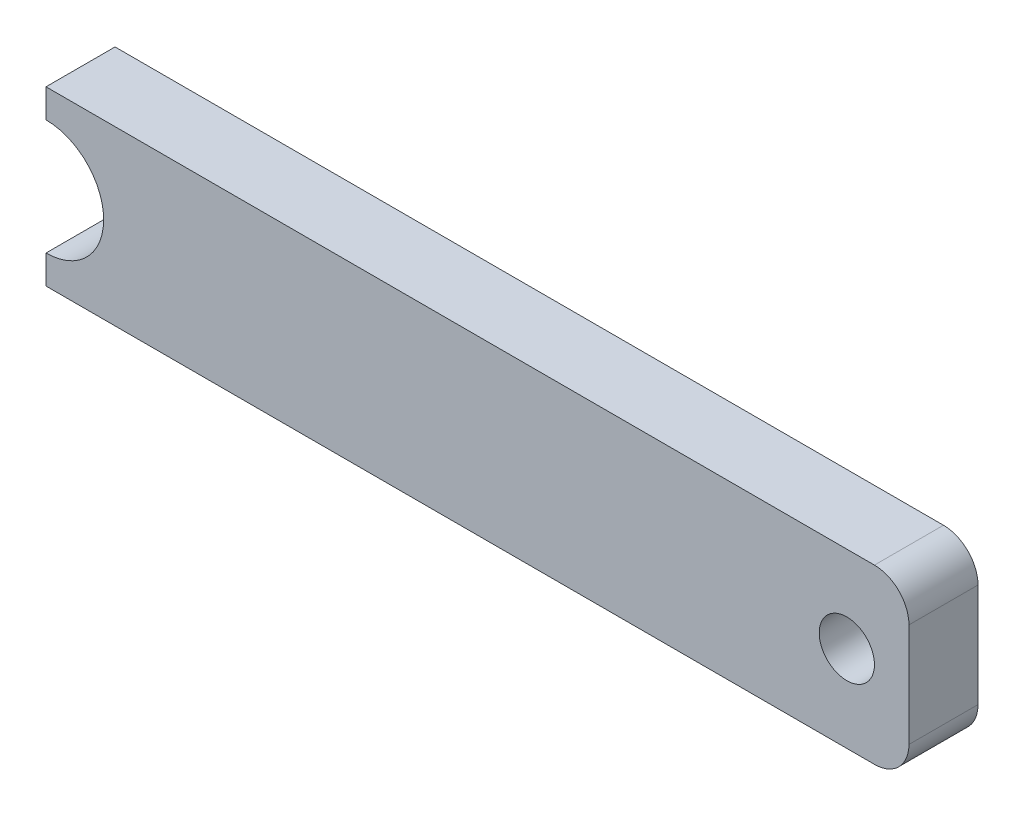
ISO-10303-21;
HEADER;
FILE_DESCRIPTION(('STEP AP214'),'2;1');
FILE_NAME('part.step','',(''),(''),'','','');
FILE_SCHEMA(('AUTOMOTIVE_DESIGN { 1 0 10303 214 1 1 1 1 }'));
ENDSEC;
DATA;
#1=APPLICATION_CONTEXT('core data for automotive mechanical design processes');
#2=APPLICATION_PROTOCOL_DEFINITION('international standard','automotive_design',2000,#1);
#3=PRODUCT_CONTEXT('',#1,'mechanical');
#4=PRODUCT('Part','Part','',(#3));
#5=PRODUCT_RELATED_PRODUCT_CATEGORY('part','',(#4));
#6=PRODUCT_DEFINITION_FORMATION('','',#4);
#7=PRODUCT_DEFINITION_CONTEXT('part definition',#1,'design');
#8=PRODUCT_DEFINITION('design','',#6,#7);
#9=PRODUCT_DEFINITION_SHAPE('','',#8);
#10=(LENGTH_UNIT() NAMED_UNIT(*) SI_UNIT(.MILLI.,.METRE.));
#11=(NAMED_UNIT(*) PLANE_ANGLE_UNIT() SI_UNIT($,.RADIAN.));
#12=(NAMED_UNIT(*) SI_UNIT($,.STERADIAN.) SOLID_ANGLE_UNIT());
#13=UNCERTAINTY_MEASURE_WITH_UNIT(LENGTH_MEASURE(1.E-05),#10,'distance_accuracy_value','');
#14=(GEOMETRIC_REPRESENTATION_CONTEXT(3) GLOBAL_UNCERTAINTY_ASSIGNED_CONTEXT((#13)) GLOBAL_UNIT_ASSIGNED_CONTEXT((#10,
#11,#12)) REPRESENTATION_CONTEXT('',''));
#15=CARTESIAN_POINT('',(0.,0.,0.));
#16=DIRECTION('',(0.,0.,1.));
#17=DIRECTION('',(1.,0.,0.));
#18=AXIS2_PLACEMENT_3D('',#15,#16,#17);
#19=CARTESIAN_POINT('',(-62.5,0.,10.));
#20=DIRECTION('',(0.,0.,1.));
#21=DIRECTION('',(1.,0.,0.));
#22=AXIS2_PLACEMENT_3D('',#19,#20,#21);
#23=PLANE('',#22);
#24=DIRECTION('',(0.,-1.,0.));
#25=VECTOR('',#24,1.);
#26=CARTESIAN_POINT('',(-62.5,12.5,10.));
#27=LINE('',#26,#25);
#28=CARTESIAN_POINT('',(-62.5,12.5,10.));
#29=VERTEX_POINT('',#28);
#30=CARTESIAN_POINT('',(-62.5,8.35,10.));
#31=VERTEX_POINT('',#30);
#32=EDGE_CURVE('E145',#29,#31,#27,.T.);
#33=ORIENTED_EDGE('',*,*,#32,.T.);
#34=CARTESIAN_POINT('',(-62.5,0.,10.));
#35=DIRECTION('',(0.,0.,-1.));
#36=DIRECTION('',(1.,0.,0.));
#37=AXIS2_PLACEMENT_3D('',#34,#35,#36);
#38=CIRCLE('',#37,8.35);
#39=CARTESIAN_POINT('',(-62.5,-8.35000000000001,10.));
#40=VERTEX_POINT('',#39);
#41=EDGE_CURVE('E93',#31,#40,#38,.T.);
#42=ORIENTED_EDGE('',*,*,#41,.T.);
#43=DIRECTION('',(0.,-1.,0.));
#44=VECTOR('',#43,1.);
#45=CARTESIAN_POINT('',(-62.5,-8.35000000000001,10.));
#46=LINE('',#45,#44);
#47=CARTESIAN_POINT('',(-62.5,-12.5,10.));
#48=VERTEX_POINT('',#47);
#49=EDGE_CURVE('E160',#40,#48,#46,.T.);
#50=ORIENTED_EDGE('',*,*,#49,.T.);
#51=DIRECTION('',(1.,0.,0.));
#52=VECTOR('',#51,1.);
#53=CARTESIAN_POINT('',(-62.5,-12.5,10.));
#54=LINE('',#53,#52);
#55=CARTESIAN_POINT('',(57.5,-12.5,10.));
#56=VERTEX_POINT('',#55);
#57=EDGE_CURVE('E173',#48,#56,#54,.T.);
#58=ORIENTED_EDGE('',*,*,#57,.T.);
#59=CARTESIAN_POINT('',(57.5,-7.50000000000001,10.));
#60=DIRECTION('',(0.,0.,1.));
#61=DIRECTION('',(-1.,0.,0.));
#62=AXIS2_PLACEMENT_3D('',#59,#60,#61);
#63=CIRCLE('',#62,5.);
#64=CARTESIAN_POINT('',(62.5,-7.49999999999997,10.));
#65=VERTEX_POINT('',#64);
#66=EDGE_CURVE('E112',#56,#65,#63,.T.);
#67=ORIENTED_EDGE('',*,*,#66,.T.);
#68=DIRECTION('',(0.,1.,0.));
#69=VECTOR('',#68,1.);
#70=CARTESIAN_POINT('',(62.5,7.49999999999996,10.));
#71=LINE('',#70,#69);
#72=CARTESIAN_POINT('',(62.5,7.49999999999996,10.));
#73=VERTEX_POINT('',#72);
#74=EDGE_CURVE('E106',#65,#73,#71,.T.);
#75=ORIENTED_EDGE('',*,*,#74,.T.);
#76=CARTESIAN_POINT('',(57.5,7.5,10.));
#77=DIRECTION('',(0.,0.,1.));
#78=DIRECTION('',(1.,0.,0.));
#79=AXIS2_PLACEMENT_3D('',#76,#77,#78);
#80=CIRCLE('',#79,5.);
#81=CARTESIAN_POINT('',(57.5,12.5,10.));
#82=VERTEX_POINT('',#81);
#83=EDGE_CURVE('E110',#73,#82,#80,.T.);
#84=ORIENTED_EDGE('',*,*,#83,.T.);
#85=DIRECTION('',(-1.,0.,0.));
#86=VECTOR('',#85,1.);
#87=CARTESIAN_POINT('',(-62.5,12.5,10.));
#88=LINE('',#87,#86);
#89=EDGE_CURVE('E50',#82,#29,#88,.T.);
#90=ORIENTED_EDGE('',*,*,#89,.T.);
#91=EDGE_LOOP('',(#33,#42,#50,#58,#67,#75,#84,#90));
#92=FACE_BOUND('',#91,.T.);
#93=CARTESIAN_POINT('',(53.5,0.,10.));
#94=DIRECTION('',(0.,0.,1.));
#95=DIRECTION('',(1.,0.,0.));
#96=AXIS2_PLACEMENT_3D('',#93,#94,#95);
#97=CIRCLE('',#96,4.);
#98=CARTESIAN_POINT('',(57.5,0.,10.));
#99=VERTEX_POINT('',#98);
#100=EDGE_CURVE('E134',#99,#99,#97,.T.);
#101=ORIENTED_EDGE('',*,*,#100,.F.);
#102=EDGE_LOOP('',(#101));
#103=FACE_BOUND('',#102,.T.);
#104=ADVANCED_FACE('F33',(#92,#103),#23,.T.);
#105=CARTESIAN_POINT('',(-62.5,0.,0.));
#106=DIRECTION('',(0.,0.,1.));
#107=DIRECTION('',(1.,0.,0.));
#108=AXIS2_PLACEMENT_3D('',#105,#106,#107);
#109=PLANE('',#108);
#110=DIRECTION('',(0.,-1.,0.));
#111=VECTOR('',#110,1.);
#112=CARTESIAN_POINT('',(-62.5,12.5,0.));
#113=LINE('',#112,#111);
#114=CARTESIAN_POINT('',(-62.5,12.5,0.));
#115=VERTEX_POINT('',#114);
#116=CARTESIAN_POINT('',(-62.5,8.35,0.));
#117=VERTEX_POINT('',#116);
#118=EDGE_CURVE('E130',#115,#117,#113,.T.);
#119=ORIENTED_EDGE('',*,*,#118,.F.);
#120=DIRECTION('',(-1.,0.,0.));
#121=VECTOR('',#120,1.);
#122=CARTESIAN_POINT('',(-62.5,12.5,0.));
#123=LINE('',#122,#121);
#124=CARTESIAN_POINT('',(57.5,12.5,0.));
#125=VERTEX_POINT('',#124);
#126=EDGE_CURVE('E85',#125,#115,#123,.T.);
#127=ORIENTED_EDGE('',*,*,#126,.F.);
#128=CARTESIAN_POINT('',(57.5,7.5,0.));
#129=DIRECTION('',(0.,0.,1.));
#130=DIRECTION('',(1.,0.,0.));
#131=AXIS2_PLACEMENT_3D('',#128,#129,#130);
#132=CIRCLE('',#131,5.);
#133=CARTESIAN_POINT('',(62.5,7.49999999999996,0.));
#134=VERTEX_POINT('',#133);
#135=EDGE_CURVE('E79',#134,#125,#132,.T.);
#136=ORIENTED_EDGE('',*,*,#135,.F.);
#137=DIRECTION('',(0.,1.,0.));
#138=VECTOR('',#137,1.);
#139=CARTESIAN_POINT('',(62.5,7.49999999999996,0.));
#140=LINE('',#139,#138);
#141=CARTESIAN_POINT('',(62.5,-7.49999999999997,0.));
#142=VERTEX_POINT('',#141);
#143=EDGE_CURVE('E120',#142,#134,#140,.T.);
#144=ORIENTED_EDGE('',*,*,#143,.F.);
#145=CARTESIAN_POINT('',(57.5,-7.50000000000001,0.));
#146=DIRECTION('',(0.,0.,1.));
#147=DIRECTION('',(-1.,0.,0.));
#148=AXIS2_PLACEMENT_3D('',#145,#146,#147);
#149=CIRCLE('',#148,5.);
#150=CARTESIAN_POINT('',(57.5,-12.5,0.));
#151=VERTEX_POINT('',#150);
#152=EDGE_CURVE('E140',#151,#142,#149,.T.);
#153=ORIENTED_EDGE('',*,*,#152,.F.);
#154=DIRECTION('',(1.,0.,0.));
#155=VECTOR('',#154,1.);
#156=CARTESIAN_POINT('',(-62.5,-12.5,0.));
#157=LINE('',#156,#155);
#158=CARTESIAN_POINT('',(-62.5,-12.5,0.));
#159=VERTEX_POINT('',#158);
#160=EDGE_CURVE('E138',#159,#151,#157,.T.);
#161=ORIENTED_EDGE('',*,*,#160,.F.);
#162=DIRECTION('',(0.,-1.,0.));
#163=VECTOR('',#162,1.);
#164=CARTESIAN_POINT('',(-62.5,-8.35000000000001,0.));
#165=LINE('',#164,#163);
#166=CARTESIAN_POINT('',(-62.5,-8.35000000000001,0.));
#167=VERTEX_POINT('',#166);
#168=EDGE_CURVE('E136',#167,#159,#165,.T.);
#169=ORIENTED_EDGE('',*,*,#168,.F.);
#170=CARTESIAN_POINT('',(-62.5,0.,0.));
#171=DIRECTION('',(0.,0.,-1.));
#172=DIRECTION('',(1.,0.,0.));
#173=AXIS2_PLACEMENT_3D('',#170,#171,#172);
#174=CIRCLE('',#173,8.35);
#175=EDGE_CURVE('E133',#117,#167,#174,.T.);
#176=ORIENTED_EDGE('',*,*,#175,.F.);
#177=EDGE_LOOP('',(#119,#127,#136,#144,#153,#161,#169,#176));
#178=FACE_BOUND('',#177,.T.);
#179=CARTESIAN_POINT('',(53.5,0.,0.));
#180=DIRECTION('',(0.,0.,1.));
#181=DIRECTION('',(1.,0.,0.));
#182=AXIS2_PLACEMENT_3D('',#179,#180,#181);
#183=CIRCLE('',#182,4.);
#184=CARTESIAN_POINT('',(57.5,0.,0.));
#185=VERTEX_POINT('',#184);
#186=EDGE_CURVE('E179',#185,#185,#183,.T.);
#187=ORIENTED_EDGE('',*,*,#186,.T.);
#188=EDGE_LOOP('',(#187));
#189=FACE_BOUND('',#188,.T.);
#190=ADVANCED_FACE('F164',(#178,#189),#109,.F.);
#191=CARTESIAN_POINT('',(-62.5,12.5,10.));
#192=DIRECTION('',(1.,0.,0.));
#193=DIRECTION('',(0.,0.,-1.));
#194=AXIS2_PLACEMENT_3D('',#191,#192,#193);
#195=PLANE('',#194);
#196=ORIENTED_EDGE('',*,*,#118,.T.);
#197=DIRECTION('',(0.,0.,-1.));
#198=VECTOR('',#197,1.);
#199=CARTESIAN_POINT('',(-62.5,8.35,10.));
#200=LINE('',#199,#198);
#201=EDGE_CURVE('E11',#31,#117,#200,.T.);
#202=ORIENTED_EDGE('',*,*,#201,.F.);
#203=ORIENTED_EDGE('',*,*,#32,.F.);
#204=DIRECTION('',(0.,0.,-1.));
#205=VECTOR('',#204,1.);
#206=CARTESIAN_POINT('',(-62.5,12.5,10.));
#207=LINE('',#206,#205);
#208=EDGE_CURVE('E126',#29,#115,#207,.T.);
#209=ORIENTED_EDGE('',*,*,#208,.T.);
#210=EDGE_LOOP('',(#196,#202,#203,#209));
#211=FACE_BOUND('',#210,.T.);
#212=ADVANCED_FACE('F35',(#211),#195,.F.);
#213=CARTESIAN_POINT('',(-62.5,0.,10.));
#214=DIRECTION('',(0.,0.,-1.));
#215=DIRECTION('',(-1.,0.,0.));
#216=AXIS2_PLACEMENT_3D('',#213,#214,#215);
#217=CYLINDRICAL_SURFACE('',#216,8.35);
#218=ORIENTED_EDGE('',*,*,#175,.T.);
#219=DIRECTION('',(0.,0.,-1.));
#220=VECTOR('',#219,1.);
#221=CARTESIAN_POINT('',(-62.5,-8.35000000000001,10.));
#222=LINE('',#221,#220);
#223=EDGE_CURVE('E42',#40,#167,#222,.T.);
#224=ORIENTED_EDGE('',*,*,#223,.F.);
#225=ORIENTED_EDGE('',*,*,#41,.F.);
#226=ORIENTED_EDGE('',*,*,#201,.T.);
#227=EDGE_LOOP('',(#218,#224,#225,#226));
#228=FACE_BOUND('',#227,.T.);
#229=ADVANCED_FACE('F207',(#228),#217,.F.);
#230=CARTESIAN_POINT('',(-62.5,-8.35000000000001,10.));
#231=DIRECTION('',(1.,0.,0.));
#232=DIRECTION('',(0.,1.,0.));
#233=AXIS2_PLACEMENT_3D('',#230,#231,#232);
#234=PLANE('',#233);
#235=ORIENTED_EDGE('',*,*,#168,.T.);
#236=DIRECTION('',(0.,0.,-1.));
#237=VECTOR('',#236,1.);
#238=CARTESIAN_POINT('',(-62.5,-12.5,10.));
#239=LINE('',#238,#237);
#240=EDGE_CURVE('E152',#48,#159,#239,.T.);
#241=ORIENTED_EDGE('',*,*,#240,.F.);
#242=ORIENTED_EDGE('',*,*,#49,.F.);
#243=ORIENTED_EDGE('',*,*,#223,.T.);
#244=EDGE_LOOP('',(#235,#241,#242,#243));
#245=FACE_BOUND('',#244,.T.);
#246=ADVANCED_FACE('F158',(#245),#234,.F.);
#247=CARTESIAN_POINT('',(-62.5,-12.5,10.));
#248=DIRECTION('',(0.,1.,0.));
#249=DIRECTION('',(0.,0.,1.));
#250=AXIS2_PLACEMENT_3D('',#247,#248,#249);
#251=PLANE('',#250);
#252=ORIENTED_EDGE('',*,*,#160,.T.);
#253=DIRECTION('',(0.,0.,-1.));
#254=VECTOR('',#253,1.);
#255=CARTESIAN_POINT('',(57.5,-12.5,10.));
#256=LINE('',#255,#254);
#257=EDGE_CURVE('E149',#56,#151,#256,.T.);
#258=ORIENTED_EDGE('',*,*,#257,.F.);
#259=ORIENTED_EDGE('',*,*,#57,.F.);
#260=ORIENTED_EDGE('',*,*,#240,.T.);
#261=EDGE_LOOP('',(#252,#258,#259,#260));
#262=FACE_BOUND('',#261,.T.);
#263=ADVANCED_FACE('F169',(#262),#251,.F.);
#264=CARTESIAN_POINT('',(57.5,-7.50000000000001,10.));
#265=DIRECTION('',(0.,0.,-1.));
#266=DIRECTION('',(-1.,0.,0.));
#267=AXIS2_PLACEMENT_3D('',#264,#265,#266);
#268=CYLINDRICAL_SURFACE('',#267,5.);
#269=ORIENTED_EDGE('',*,*,#152,.T.);
#270=DIRECTION('',(0.,0.,-1.));
#271=VECTOR('',#270,1.);
#272=CARTESIAN_POINT('',(62.5,-7.49999999999997,10.));
#273=LINE('',#272,#271);
#274=EDGE_CURVE('E121',#65,#142,#273,.T.);
#275=ORIENTED_EDGE('',*,*,#274,.F.);
#276=ORIENTED_EDGE('',*,*,#66,.F.);
#277=ORIENTED_EDGE('',*,*,#257,.T.);
#278=EDGE_LOOP('',(#269,#275,#276,#277));
#279=FACE_BOUND('',#278,.T.);
#280=ADVANCED_FACE('F172',(#279),#268,.T.);
#281=CARTESIAN_POINT('',(62.5,7.49999999999996,10.));
#282=DIRECTION('',(-1.,0.,0.));
#283=DIRECTION('',(0.,0.,1.));
#284=AXIS2_PLACEMENT_3D('',#281,#282,#283);
#285=PLANE('',#284);
#286=ORIENTED_EDGE('',*,*,#143,.T.);
#287=DIRECTION('',(0.,0.,-1.));
#288=VECTOR('',#287,1.);
#289=CARTESIAN_POINT('',(62.5,7.49999999999996,10.));
#290=LINE('',#289,#288);
#291=EDGE_CURVE('E117',#73,#134,#290,.T.);
#292=ORIENTED_EDGE('',*,*,#291,.F.);
#293=ORIENTED_EDGE('',*,*,#74,.F.);
#294=ORIENTED_EDGE('',*,*,#274,.T.);
#295=EDGE_LOOP('',(#286,#292,#293,#294));
#296=FACE_BOUND('',#295,.T.);
#297=ADVANCED_FACE('F118',(#296),#285,.F.);
#298=CARTESIAN_POINT('',(57.5,7.5,10.));
#299=DIRECTION('',(0.,0.,-1.));
#300=DIRECTION('',(-1.,0.,0.));
#301=AXIS2_PLACEMENT_3D('',#298,#299,#300);
#302=CYLINDRICAL_SURFACE('',#301,5.);
#303=ORIENTED_EDGE('',*,*,#135,.T.);
#304=DIRECTION('',(0.,0.,-1.));
#305=VECTOR('',#304,1.);
#306=CARTESIAN_POINT('',(57.5,12.5,10.));
#307=LINE('',#306,#305);
#308=EDGE_CURVE('E122',#82,#125,#307,.T.);
#309=ORIENTED_EDGE('',*,*,#308,.F.);
#310=ORIENTED_EDGE('',*,*,#83,.F.);
#311=ORIENTED_EDGE('',*,*,#291,.T.);
#312=EDGE_LOOP('',(#303,#309,#310,#311));
#313=FACE_BOUND('',#312,.T.);
#314=ADVANCED_FACE('F124',(#313),#302,.T.);
#315=CARTESIAN_POINT('',(-62.5,12.5,10.));
#316=DIRECTION('',(0.,-1.,0.));
#317=DIRECTION('',(0.,0.,-1.));
#318=AXIS2_PLACEMENT_3D('',#315,#316,#317);
#319=PLANE('',#318);
#320=ORIENTED_EDGE('',*,*,#126,.T.);
#321=ORIENTED_EDGE('',*,*,#208,.F.);
#322=ORIENTED_EDGE('',*,*,#89,.F.);
#323=ORIENTED_EDGE('',*,*,#308,.T.);
#324=EDGE_LOOP('',(#320,#321,#322,#323));
#325=FACE_BOUND('',#324,.T.);
#326=ADVANCED_FACE('F195',(#325),#319,.F.);
#327=CARTESIAN_POINT('',(53.5,0.,10.));
#328=DIRECTION('',(0.,0.,-1.));
#329=DIRECTION('',(-1.,0.,0.));
#330=AXIS2_PLACEMENT_3D('',#327,#328,#329);
#331=CYLINDRICAL_SURFACE('',#330,4.);
#332=ORIENTED_EDGE('',*,*,#100,.T.);
#333=EDGE_LOOP('',(#332));
#334=FACE_BOUND('',#333,.T.);
#335=ORIENTED_EDGE('',*,*,#186,.F.);
#336=EDGE_LOOP('',(#335));
#337=FACE_BOUND('',#336,.T.);
#338=ADVANCED_FACE('F185',(#334,#337),#331,.F.);
#339=CLOSED_SHELL('',(#104,#190,#212,#229,#246,#263,#280,#297,#314,#326,#338));
#340=MANIFOLD_SOLID_BREP('B2',#339);
#341=ADVANCED_BREP_SHAPE_REPRESENTATION('',(#18,#340),#14);
#342=SHAPE_DEFINITION_REPRESENTATION(#9,#341);
ENDSEC;
END-ISO-10303-21;
